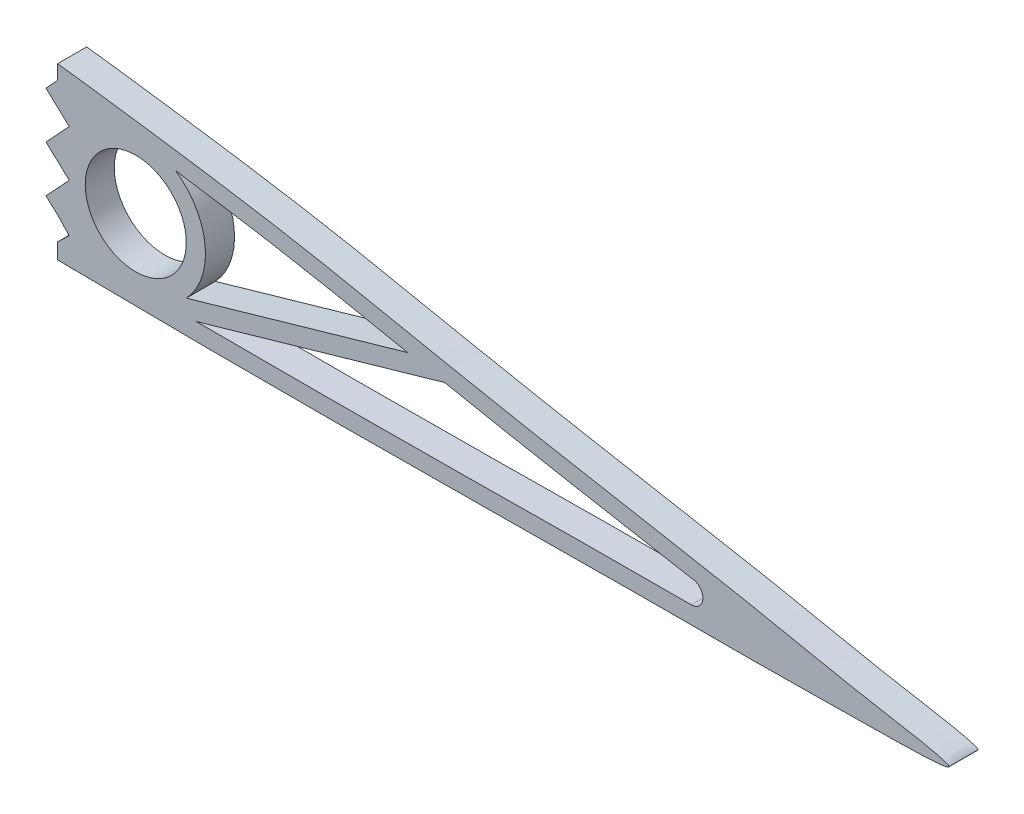
ISO-10303-21;
HEADER;
FILE_DESCRIPTION(('STEP AP214'),'2;1');
FILE_NAME('part.step','',(''),(''),'','','');
FILE_SCHEMA(('AUTOMOTIVE_DESIGN { 1 0 10303 214 1 1 1 1 }'));
ENDSEC;
DATA;
#1=APPLICATION_CONTEXT('core data for automotive mechanical design processes');
#2=APPLICATION_PROTOCOL_DEFINITION('international standard','automotive_design',2000,#1);
#3=PRODUCT_CONTEXT('',#1,'mechanical');
#4=PRODUCT('Part','Part','',(#3));
#5=PRODUCT_RELATED_PRODUCT_CATEGORY('part','',(#4));
#6=PRODUCT_DEFINITION_FORMATION('','',#4);
#7=PRODUCT_DEFINITION_CONTEXT('part definition',#1,'design');
#8=PRODUCT_DEFINITION('design','',#6,#7);
#9=PRODUCT_DEFINITION_SHAPE('','',#8);
#10=(LENGTH_UNIT() NAMED_UNIT(*) SI_UNIT(.MILLI.,.METRE.));
#11=(NAMED_UNIT(*) PLANE_ANGLE_UNIT() SI_UNIT($,.RADIAN.));
#12=(NAMED_UNIT(*) SI_UNIT($,.STERADIAN.) SOLID_ANGLE_UNIT());
#13=UNCERTAINTY_MEASURE_WITH_UNIT(LENGTH_MEASURE(1.E-05),#10,'distance_accuracy_value','');
#14=(GEOMETRIC_REPRESENTATION_CONTEXT(3) GLOBAL_UNCERTAINTY_ASSIGNED_CONTEXT((#13)) GLOBAL_UNIT_ASSIGNED_CONTEXT((#10,
#11,#12)) REPRESENTATION_CONTEXT('',''));
#15=CARTESIAN_POINT('',(0.,0.,0.));
#16=DIRECTION('',(0.,0.,1.));
#17=DIRECTION('',(1.,0.,0.));
#18=AXIS2_PLACEMENT_3D('',#15,#16,#17);
#19=CARTESIAN_POINT('',(160.714304874947,1.94266784174451,-0.0126133328246878));
#20=DIRECTION('',(-1.,0.,0.));
#21=DIRECTION('',(0.,0.,1.));
#22=AXIS2_PLACEMENT_3D('',#19,#20,#21);
#23=PLANE('',#22);
#24=DIRECTION('',(0.,0.,-1.));
#25=VECTOR('',#24,1.);
#26=CARTESIAN_POINT('',(160.714304874947,-1.48396448078185,-40.7418292483838));
#27=LINE('',#26,#25);
#28=CARTESIAN_POINT('',(160.714304874947,-1.48396448078185,6.35000000000003));
#29=VERTEX_POINT('',#28);
#30=CARTESIAN_POINT('',(160.714304874947,-1.48396448078185,0.));
#31=VERTEX_POINT('',#30);
#32=EDGE_CURVE('E352',#29,#31,#27,.T.);
#33=ORIENTED_EDGE('',*,*,#32,.F.);
#34=DIRECTION('',(0.,1.,0.));
#35=VECTOR('',#34,1.);
#36=CARTESIAN_POINT('',(160.714304874947,6.31608258581797,6.35));
#37=LINE('',#36,#35);
#38=CARTESIAN_POINT('',(160.714304874947,1.94266784174451,6.35));
#39=VERTEX_POINT('',#38);
#40=EDGE_CURVE('E292',#29,#39,#37,.T.);
#41=ORIENTED_EDGE('',*,*,#40,.T.);
#42=DIRECTION('',(0.,0.,1.));
#43=VECTOR('',#42,1.);
#44=CARTESIAN_POINT('',(160.714304874947,1.94266784174451,-0.0126133328246878));
#45=LINE('',#44,#43);
#46=CARTESIAN_POINT('',(160.714304874947,1.94266784174451,0.));
#47=VERTEX_POINT('',#46);
#48=EDGE_CURVE('E11',#47,#39,#45,.T.);
#49=ORIENTED_EDGE('',*,*,#48,.F.);
#50=DIRECTION('',(0.,1.,0.));
#51=VECTOR('',#50,1.);
#52=CARTESIAN_POINT('',(160.714304874947,6.31608258581797,0.));
#53=LINE('',#52,#51);
#54=EDGE_CURVE('E349',#31,#47,#53,.T.);
#55=ORIENTED_EDGE('',*,*,#54,.F.);
#56=EDGE_LOOP('',(#33,#41,#49,#55));
#57=FACE_BOUND('',#56,.T.);
#58=ADVANCED_FACE('F33',(#57),#23,.T.);
#59=CARTESIAN_POINT('',(163.254304874947,4.38005033954691,-0.0126133328246878));
#60=DIRECTION('',(-0.692381397123979,0.721531704720345,0.));
#61=DIRECTION('',(-0.721531704720345,-0.692381397123979,0.));
#62=AXIS2_PLACEMENT_3D('',#59,#60,#61);
#63=PLANE('',#62);
#64=ORIENTED_EDGE('',*,*,#48,.T.);
#65=DIRECTION('',(0.721531704720345,0.692381397123979,0.));
#66=VECTOR('',#65,1.);
#67=CARTESIAN_POINT('',(80.268140822794,-75.2534236055233,6.35));
#68=LINE('',#67,#66);
#69=CARTESIAN_POINT('',(163.254304874947,4.38005033954687,6.35));
#70=VERTEX_POINT('',#69);
#71=EDGE_CURVE('E295',#39,#70,#68,.T.);
#72=ORIENTED_EDGE('',*,*,#71,.T.);
#73=DIRECTION('',(0.,0.,1.));
#74=VECTOR('',#73,1.);
#75=CARTESIAN_POINT('',(163.254304874947,4.38005033954691,-0.0126133328246878));
#76=LINE('',#75,#74);
#77=CARTESIAN_POINT('',(163.254304874947,4.38005033954687,0.));
#78=VERTEX_POINT('',#77);
#79=EDGE_CURVE('E45',#78,#70,#76,.T.);
#80=ORIENTED_EDGE('',*,*,#79,.F.);
#81=DIRECTION('',(0.721531704720345,0.692381397123979,0.));
#82=VECTOR('',#81,1.);
#83=CARTESIAN_POINT('',(80.268140822794,-75.2534236055233,0.));
#84=LINE('',#83,#82);
#85=EDGE_CURVE('E346',#47,#78,#84,.T.);
#86=ORIENTED_EDGE('',*,*,#85,.F.);
#87=EDGE_LOOP('',(#64,#72,#80,#86));
#88=FACE_BOUND('',#87,.T.);
#89=ADVANCED_FACE('F390',(#88),#63,.T.);
#90=CARTESIAN_POINT('',(160.714304874947,7.02698819432221,-0.0126133328246878));
#91=DIRECTION('',(-0.721531704720345,-0.692381397123979,0.));
#92=DIRECTION('',(0.692381397123979,-0.721531704720345,0.));
#93=AXIS2_PLACEMENT_3D('',#90,#91,#92);
#94=PLANE('',#93);
#95=ORIENTED_EDGE('',*,*,#79,.T.);
#96=DIRECTION('',(-0.692381397123979,0.721531704720345,0.));
#97=VECTOR('',#96,1.);
#98=CARTESIAN_POINT('',(84.9802549752778,85.9495565308882,6.35));
#99=LINE('',#98,#97);
#100=CARTESIAN_POINT('',(160.714304874947,7.02698819432221,6.35));
#101=VERTEX_POINT('',#100);
#102=EDGE_CURVE('E298',#70,#101,#99,.T.);
#103=ORIENTED_EDGE('',*,*,#102,.T.);
#104=DIRECTION('',(0.,0.,1.));
#105=VECTOR('',#104,1.);
#106=CARTESIAN_POINT('',(160.714304874947,7.02698819432221,-0.0126133328246878));
#107=LINE('',#106,#105);
#108=CARTESIAN_POINT('',(160.714304874947,7.02698819432221,0.));
#109=VERTEX_POINT('',#108);
#110=EDGE_CURVE('E372',#109,#101,#107,.T.);
#111=ORIENTED_EDGE('',*,*,#110,.F.);
#112=DIRECTION('',(-0.692381397123979,0.721531704720345,0.));
#113=VECTOR('',#112,1.);
#114=CARTESIAN_POINT('',(84.9802549752778,85.9495565308882,0.));
#115=LINE('',#114,#113);
#116=EDGE_CURVE('E343',#78,#109,#115,.T.);
#117=ORIENTED_EDGE('',*,*,#116,.F.);
#118=EDGE_LOOP('',(#95,#103,#111,#117));
#119=FACE_BOUND('',#118,.T.);
#120=ADVANCED_FACE('F379',(#119),#94,.T.);
#121=CARTESIAN_POINT('',(158.174304874947,9.38977889197246,-0.0126133328246878));
#122=DIRECTION('',(-0.681103942473555,-0.732186738166556,0.));
#123=DIRECTION('',(0.732186738166556,-0.681103942473555,0.));
#124=AXIS2_PLACEMENT_3D('',#121,#122,#123);
#125=PLANE('',#124);
#126=ORIENTED_EDGE('',*,*,#110,.T.);
#127=DIRECTION('',(-0.732186738166556,0.681103942473555,0.));
#128=VECTOR('',#127,1.);
#129=CARTESIAN_POINT('',(75.9793330126459,85.8502178328666,6.35));
#130=LINE('',#129,#128);
#131=CARTESIAN_POINT('',(158.174304874947,9.38977889197247,6.35));
#132=VERTEX_POINT('',#131);
#133=EDGE_CURVE('E301',#101,#132,#130,.T.);
#134=ORIENTED_EDGE('',*,*,#133,.T.);
#135=DIRECTION('',(0.,0.,1.));
#136=VECTOR('',#135,1.);
#137=CARTESIAN_POINT('',(158.174304874947,9.38977889197246,-0.0126133328246878));
#138=LINE('',#137,#136);
#139=CARTESIAN_POINT('',(158.174304874947,9.38977889197247,0.));
#140=VERTEX_POINT('',#139);
#141=EDGE_CURVE('E369',#140,#132,#138,.T.);
#142=ORIENTED_EDGE('',*,*,#141,.F.);
#143=DIRECTION('',(-0.732186738166556,0.681103942473555,0.));
#144=VECTOR('',#143,1.);
#145=CARTESIAN_POINT('',(75.9793330126459,85.8502178328666,0.));
#146=LINE('',#145,#144);
#147=EDGE_CURVE('E340',#109,#140,#146,.T.);
#148=ORIENTED_EDGE('',*,*,#147,.F.);
#149=EDGE_LOOP('',(#126,#134,#142,#148));
#150=FACE_BOUND('',#149,.T.);
#151=ADVANCED_FACE('F399',(#150),#125,.T.);
#152=CARTESIAN_POINT('',(160.714304874947,12.1202788920004,-0.0126133328246878));
#153=DIRECTION('',(-0.732186738166556,0.681103942473555,0.));
#154=DIRECTION('',(-0.681103942473555,-0.732186738166556,0.));
#155=AXIS2_PLACEMENT_3D('',#152,#153,#154);
#156=PLANE('',#155);
#157=ORIENTED_EDGE('',*,*,#141,.T.);
#158=DIRECTION('',(0.681103942473555,0.732186738166556,0.));
#159=VECTOR('',#158,1.);
#160=CARTESIAN_POINT('',(84.1890627854258,-70.1443563550762,6.35));
#161=LINE('',#160,#159);
#162=CARTESIAN_POINT('',(163.254304874947,14.8507788920283,6.35));
#163=VERTEX_POINT('',#162);
#164=EDGE_CURVE('E304',#132,#163,#161,.T.);
#165=ORIENTED_EDGE('',*,*,#164,.T.);
#166=DIRECTION('',(0.,0.,1.));
#167=VECTOR('',#166,1.);
#168=CARTESIAN_POINT('',(163.254304874947,14.8507788920283,-0.0126133328246878));
#169=LINE('',#168,#167);
#170=CARTESIAN_POINT('',(163.254304874947,14.8507788920283,0.));
#171=VERTEX_POINT('',#170);
#172=EDGE_CURVE('E366',#171,#163,#169,.T.);
#173=ORIENTED_EDGE('',*,*,#172,.F.);
#174=DIRECTION('',(0.681103942473555,0.732186738166556,0.));
#175=VECTOR('',#174,1.);
#176=CARTESIAN_POINT('',(84.1890627854258,-70.1443563550762,0.));
#177=LINE('',#176,#175);
#178=EDGE_CURVE('E337',#140,#171,#177,.T.);
#179=ORIENTED_EDGE('',*,*,#178,.F.);
#180=EDGE_LOOP('',(#157,#165,#173,#179));
#181=FACE_BOUND('',#180,.T.);
#182=ADVANCED_FACE('F477',(#181),#156,.T.);
#183=CARTESIAN_POINT('',(160.714304874947,17.2135695896785,-0.0126133328246878));
#184=DIRECTION('',(-0.681103942473556,-0.732186738166555,0.));
#185=DIRECTION('',(0.732186738166555,-0.681103942473556,0.));
#186=AXIS2_PLACEMENT_3D('',#183,#184,#185);
#187=PLANE('',#186);
#188=ORIENTED_EDGE('',*,*,#172,.T.);
#189=DIRECTION('',(-0.732186738166555,0.681103942473556,0.));
#190=VECTOR('',#189,1.);
#191=CARTESIAN_POINT('',(81.0593330126461,91.3112178329224,6.35));
#192=LINE('',#191,#190);
#193=CARTESIAN_POINT('',(158.174304874947,19.5763602873288,6.35));
#194=VERTEX_POINT('',#193);
#195=EDGE_CURVE('E307',#163,#194,#192,.T.);
#196=ORIENTED_EDGE('',*,*,#195,.T.);
#197=DIRECTION('',(0.,0.,1.));
#198=VECTOR('',#197,1.);
#199=CARTESIAN_POINT('',(158.174304874947,19.5763602873287,-0.0126133328246878));
#200=LINE('',#199,#198);
#201=CARTESIAN_POINT('',(158.174304874947,19.5763602873288,0.));
#202=VERTEX_POINT('',#201);
#203=EDGE_CURVE('E363',#202,#194,#200,.T.);
#204=ORIENTED_EDGE('',*,*,#203,.F.);
#205=DIRECTION('',(-0.732186738166555,0.681103942473556,0.));
#206=VECTOR('',#205,1.);
#207=CARTESIAN_POINT('',(81.0593330126461,91.3112178329224,0.));
#208=LINE('',#207,#206);
#209=EDGE_CURVE('E334',#171,#202,#208,.T.);
#210=ORIENTED_EDGE('',*,*,#209,.F.);
#211=EDGE_LOOP('',(#188,#196,#204,#210));
#212=FACE_BOUND('',#211,.T.);
#213=ADVANCED_FACE('F473',(#212),#187,.T.);
#214=CARTESIAN_POINT('',(160.714304874947,22.3068602873566,-0.0126133328246878));
#215=DIRECTION('',(-0.732186738166556,0.681103942473555,0.));
#216=DIRECTION('',(-0.681103942473555,-0.732186738166556,0.));
#217=AXIS2_PLACEMENT_3D('',#214,#215,#216);
#218=PLANE('',#217);
#219=ORIENTED_EDGE('',*,*,#203,.T.);
#220=DIRECTION('',(0.681103942473555,0.732186738166556,0.));
#221=VECTOR('',#220,1.);
#222=CARTESIAN_POINT('',(79.1090627854259,-65.4187749597757,6.35));
#223=LINE('',#222,#221);
#224=CARTESIAN_POINT('',(163.254304874947,25.0373602873845,6.35));
#225=VERTEX_POINT('',#224);
#226=EDGE_CURVE('E310',#194,#225,#223,.T.);
#227=ORIENTED_EDGE('',*,*,#226,.T.);
#228=DIRECTION('',(0.,0.,1.));
#229=VECTOR('',#228,1.);
#230=CARTESIAN_POINT('',(163.254304874947,25.0373602873845,-0.0126133328246878));
#231=LINE('',#230,#229);
#232=CARTESIAN_POINT('',(163.254304874947,25.0373602873845,0.));
#233=VERTEX_POINT('',#232);
#234=EDGE_CURVE('E360',#233,#225,#231,.T.);
#235=ORIENTED_EDGE('',*,*,#234,.F.);
#236=DIRECTION('',(0.681103942473555,0.732186738166556,0.));
#237=VECTOR('',#236,1.);
#238=CARTESIAN_POINT('',(79.1090627854259,-65.4187749597757,0.));
#239=LINE('',#238,#237);
#240=EDGE_CURVE('E331',#202,#233,#239,.T.);
#241=ORIENTED_EDGE('',*,*,#240,.F.);
#242=EDGE_LOOP('',(#219,#227,#235,#241));
#243=FACE_BOUND('',#242,.T.);
#244=ADVANCED_FACE('F469',(#243),#218,.T.);
#245=CARTESIAN_POINT('',(160.714304874947,27.4001509850348,-0.0126133328246878));
#246=DIRECTION('',(-0.681103942473555,-0.732186738166556,0.));
#247=DIRECTION('',(0.732186738166556,-0.681103942473555,0.));
#248=AXIS2_PLACEMENT_3D('',#245,#246,#247);
#249=PLANE('',#248);
#250=ORIENTED_EDGE('',*,*,#234,.T.);
#251=DIRECTION('',(-0.732186738166556,0.681103942473555,0.));
#252=VECTOR('',#251,1.);
#253=CARTESIAN_POINT('',(86.1393330126459,96.7722178329782,6.35));
#254=LINE('',#253,#252);
#255=CARTESIAN_POINT('',(158.174304874947,29.7629416826851,6.35));
#256=VERTEX_POINT('',#255);
#257=EDGE_CURVE('E313',#225,#256,#254,.T.);
#258=ORIENTED_EDGE('',*,*,#257,.T.);
#259=DIRECTION('',(0.,0.,1.));
#260=VECTOR('',#259,1.);
#261=CARTESIAN_POINT('',(158.174304874947,29.762941682685,-0.0126133328246878));
#262=LINE('',#261,#260);
#263=CARTESIAN_POINT('',(158.174304874947,29.7629416826851,0.));
#264=VERTEX_POINT('',#263);
#265=EDGE_CURVE('E357',#264,#256,#262,.T.);
#266=ORIENTED_EDGE('',*,*,#265,.F.);
#267=DIRECTION('',(-0.732186738166556,0.681103942473555,0.));
#268=VECTOR('',#267,1.);
#269=CARTESIAN_POINT('',(86.1393330126459,96.7722178329782,0.));
#270=LINE('',#269,#268);
#271=EDGE_CURVE('E328',#233,#264,#270,.T.);
#272=ORIENTED_EDGE('',*,*,#271,.F.);
#273=EDGE_LOOP('',(#250,#258,#266,#272));
#274=FACE_BOUND('',#273,.T.);
#275=ADVANCED_FACE('F475',(#274),#249,.T.);
#276=CARTESIAN_POINT('',(160.714304874947,32.4934416827129,-0.0126133328246878));
#277=DIRECTION('',(-1.,0.,0.));
#278=DIRECTION('',(0.,0.,1.));
#279=AXIS2_PLACEMENT_3D('',#276,#277,#278);
#280=PLANE('',#279);
#281=DIRECTION('',(0.,0.,1.));
#282=VECTOR('',#281,1.);
#283=CARTESIAN_POINT('',(160.714304874947,32.4934416827129,-0.0126133328246878));
#284=LINE('',#283,#282);
#285=CARTESIAN_POINT('',(160.714304874947,32.4934416827129,0.));
#286=VERTEX_POINT('',#285);
#287=CARTESIAN_POINT('',(160.714304874947,32.4934416827129,6.35));
#288=VERTEX_POINT('',#287);
#289=EDGE_CURVE('E157',#286,#288,#284,.T.);
#290=ORIENTED_EDGE('',*,*,#289,.T.);
#291=DIRECTION('',(0.,1.,0.));
#292=VECTOR('',#291,1.);
#293=CARTESIAN_POINT('',(160.714304874947,6.31608258581797,6.35));
#294=LINE('',#293,#292);
#295=CARTESIAN_POINT('',(160.714304874947,35.6684416827129,6.35));
#296=VERTEX_POINT('',#295);
#297=EDGE_CURVE('E319',#288,#296,#294,.T.);
#298=ORIENTED_EDGE('',*,*,#297,.T.);
#299=DIRECTION('',(0.,0.,-1.));
#300=VECTOR('',#299,1.);
#301=CARTESIAN_POINT('',(160.714304874947,35.6684416827129,6.35));
#302=LINE('',#301,#300);
#303=CARTESIAN_POINT('',(160.714304874947,35.6684416827129,0.));
#304=VERTEX_POINT('',#303);
#305=EDGE_CURVE('E286',#296,#304,#302,.T.);
#306=ORIENTED_EDGE('',*,*,#305,.T.);
#307=DIRECTION('',(0.,1.,0.));
#308=VECTOR('',#307,1.);
#309=CARTESIAN_POINT('',(160.714304874947,6.31608258581797,0.));
#310=LINE('',#309,#308);
#311=EDGE_CURVE('E322',#286,#304,#310,.T.);
#312=ORIENTED_EDGE('',*,*,#311,.F.);
#313=EDGE_LOOP('',(#290,#298,#306,#312));
#314=FACE_BOUND('',#313,.T.);
#315=ADVANCED_FACE('F178',(#314),#280,.T.);
#316=CARTESIAN_POINT('',(158.174304874947,29.762941682685,-0.0126133328246878));
#317=DIRECTION('',(-0.732186738166556,0.681103942473555,0.));
#318=DIRECTION('',(-0.681103942473555,-0.732186738166556,0.));
#319=AXIS2_PLACEMENT_3D('',#316,#317,#318);
#320=PLANE('',#319);
#321=ORIENTED_EDGE('',*,*,#265,.T.);
#322=DIRECTION('',(0.681103942473555,0.732186738166556,0.));
#323=VECTOR('',#322,1.);
#324=CARTESIAN_POINT('',(74.0290627854258,-60.6931935644752,6.35));
#325=LINE('',#324,#323);
#326=EDGE_CURVE('E316',#256,#288,#325,.T.);
#327=ORIENTED_EDGE('',*,*,#326,.T.);
#328=ORIENTED_EDGE('',*,*,#289,.F.);
#329=DIRECTION('',(0.681103942473555,0.732186738166556,0.));
#330=VECTOR('',#329,1.);
#331=CARTESIAN_POINT('',(74.0290627854258,-60.6931935644752,0.));
#332=LINE('',#331,#330);
#333=EDGE_CURVE('E325',#264,#286,#332,.T.);
#334=ORIENTED_EDGE('',*,*,#333,.F.);
#335=EDGE_LOOP('',(#321,#327,#328,#334));
#336=FACE_BOUND('',#335,.T.);
#337=ADVANCED_FACE('F489',(#336),#320,.T.);
#338=CARTESIAN_POINT('',(177.8,15.8385784888495,49.4552293811319));
#339=DIRECTION('',(0.,0.,-1.));
#340=DIRECTION('',(-1.,0.,0.));
#341=AXIS2_PLACEMENT_3D('',#338,#339,#340);
#342=CYLINDRICAL_SURFACE('',#341,11.049);
#343=CARTESIAN_POINT('',(177.8,15.8385784888495,6.35));
#344=DIRECTION('',(0.,0.,-1.));
#345=DIRECTION('',(-1.,0.,0.));
#346=AXIS2_PLACEMENT_3D('',#343,#344,#345);
#347=CIRCLE('',#346,11.049);
#348=CARTESIAN_POINT('',(166.751,15.8385784888495,6.35));
#349=VERTEX_POINT('',#348);
#350=EDGE_CURVE('E129',#349,#349,#347,.F.);
#351=ORIENTED_EDGE('',*,*,#350,.T.);
#352=EDGE_LOOP('',(#351));
#353=FACE_BOUND('',#352,.T.);
#354=CARTESIAN_POINT('',(177.8,15.8385784888495,0.));
#355=DIRECTION('',(0.,0.,-1.));
#356=DIRECTION('',(-1.,0.,0.));
#357=AXIS2_PLACEMENT_3D('',#354,#355,#356);
#358=CIRCLE('',#357,11.049);
#359=CARTESIAN_POINT('',(166.751,15.8385784888495,0.));
#360=VERTEX_POINT('',#359);
#361=EDGE_CURVE('E262',#360,#360,#358,.T.);
#362=ORIENTED_EDGE('',*,*,#361,.T.);
#363=EDGE_LOOP('',(#362));
#364=FACE_BOUND('',#363,.T.);
#365=ADVANCED_FACE('F486',(#353,#364),#342,.F.);
#366=CARTESIAN_POINT('',(298.585401197704,7.67396492833068,6.35));
#367=DIRECTION('',(-0.18053615701338,-0.983568348418574,0.));
#368=DIRECTION('',(0.983568348418574,-0.18053615701338,0.));
#369=AXIS2_PLACEMENT_3D('',#366,#367,#368);
#370=PLANE('',#369);
#371=DIRECTION('',(-0.983568348418574,0.18053615701338,0.));
#372=VECTOR('',#371,1.);
#373=CARTESIAN_POINT('',(298.585401197704,7.67396492833068,0.));
#374=LINE('',#373,#372);
#375=CARTESIAN_POINT('',(299.270885690448,7.5481427257241,0.));
#376=VERTEX_POINT('',#375);
#377=CARTESIAN_POINT('',(298.585401197704,7.67396492833066,0.));
#378=VERTEX_POINT('',#377);
#379=EDGE_CURVE('E246',#376,#378,#374,.T.);
#380=ORIENTED_EDGE('',*,*,#379,.F.);
#381=DIRECTION('',(0.,0.,-1.));
#382=VECTOR('',#381,1.);
#383=CARTESIAN_POINT('',(299.270885690448,7.5481427257241,6.35));
#384=LINE('',#383,#382);
#385=CARTESIAN_POINT('',(299.270885690448,7.54814272572409,6.35));
#386=VERTEX_POINT('',#385);
#387=EDGE_CURVE('E240',#386,#376,#384,.T.);
#388=ORIENTED_EDGE('',*,*,#387,.F.);
#389=DIRECTION('',(-0.983568348418574,0.18053615701338,0.));
#390=VECTOR('',#389,1.);
#391=CARTESIAN_POINT('',(298.585401197704,7.67396492833068,6.35));
#392=LINE('',#391,#390);
#393=CARTESIAN_POINT('',(298.585401197704,7.67396492833068,6.35));
#394=VERTEX_POINT('',#393);
#395=EDGE_CURVE('E245',#386,#394,#392,.T.);
#396=ORIENTED_EDGE('',*,*,#395,.T.);
#397=DIRECTION('',(0.,0.,-1.));
#398=VECTOR('',#397,1.);
#399=CARTESIAN_POINT('',(298.585401197704,7.67396492833068,6.35));
#400=LINE('',#399,#398);
#401=EDGE_CURVE('E242',#394,#378,#400,.T.);
#402=ORIENTED_EDGE('',*,*,#401,.T.);
#403=EDGE_LOOP('',(#380,#388,#396,#402));
#404=FACE_BOUND('',#403,.T.);
#405=ADVANCED_FACE('F488',(#404),#370,.T.);
#406=CARTESIAN_POINT('',(299.270885690451,5.0124239966776,6.35));
#407=DIRECTION('',(0.,0.,-1.));
#408=DIRECTION('',(-1.,0.,0.));
#409=AXIS2_PLACEMENT_3D('',#406,#407,#408);
#410=CYLINDRICAL_SURFACE('',#409,2.53571872904618);
#411=CARTESIAN_POINT('',(299.270885690451,5.0124239966776,0.));
#412=DIRECTION('',(0.,0.,1.));
#413=DIRECTION('',(-1.,0.,0.));
#414=AXIS2_PLACEMENT_3D('',#411,#412,#413);
#415=CIRCLE('',#414,2.53571872904618);
#416=CARTESIAN_POINT('',(299.270885690451,2.47670526763142,0.));
#417=VERTEX_POINT('',#416);
#418=EDGE_CURVE('E249',#417,#376,#415,.T.);
#419=ORIENTED_EDGE('',*,*,#418,.F.);
#420=DIRECTION('',(0.,0.,-1.));
#421=VECTOR('',#420,1.);
#422=CARTESIAN_POINT('',(299.270885690451,2.47670526763142,6.35));
#423=LINE('',#422,#421);
#424=CARTESIAN_POINT('',(299.270885690451,2.47670526763142,6.35));
#425=VERTEX_POINT('',#424);
#426=EDGE_CURVE('E237',#425,#417,#423,.T.);
#427=ORIENTED_EDGE('',*,*,#426,.F.);
#428=CARTESIAN_POINT('',(299.270885690451,5.0124239966776,6.35));
#429=DIRECTION('',(0.,0.,1.));
#430=DIRECTION('',(-1.,0.,0.));
#431=AXIS2_PLACEMENT_3D('',#428,#429,#430);
#432=CIRCLE('',#431,2.53571872904618);
#433=EDGE_CURVE('E162',#425,#386,#432,.T.);
#434=ORIENTED_EDGE('',*,*,#433,.T.);
#435=ORIENTED_EDGE('',*,*,#387,.T.);
#436=EDGE_LOOP('',(#419,#427,#434,#435));
#437=FACE_BOUND('',#436,.T.);
#438=ADVANCED_FACE('F174',(#437),#410,.F.);
#439=CARTESIAN_POINT('',(298.585401197704,7.67396492833068,6.35));
#440=CARTESIAN_POINT('',(292.106452898494,8.86319029259587,6.35));
#441=CARTESIAN_POINT('',(278.998722850691,11.2160768217091,6.35));
#442=CARTESIAN_POINT('',(260.19281594541,14.6614639423051,6.35));
#443=CARTESIAN_POINT('',(241.464676652205,18.3546402802779,6.35));
#444=CARTESIAN_POINT('',(222.627905102774,22.2809005256109,6.35));
#445=CARTESIAN_POINT('',(203.840407925316,25.7328156234177,6.35));
#446=CARTESIAN_POINT('',(184.940591078368,28.567271431143,6.35));
#447=CARTESIAN_POINT('',(165.928243186971,31.2418483670052,6.35));
#448=CARTESIAN_POINT('',(147.007574717095,33.486695381412,6.35));
#449=CARTESIAN_POINT('',(128.106318529901,34.52483508266,6.35));
#450=CARTESIAN_POINT('',(109.031352068831,34.4819079791814,6.35));
#451=CARTESIAN_POINT('',(93.1136836747986,33.9410772373976,6.35));
#452=CARTESIAN_POINT('',(80.4929697852541,33.0121230489318,6.35));
#453=CARTESIAN_POINT('',(71.0914879230405,32.0025071410935,6.35));
#454=CARTESIAN_POINT('',(61.7494496654783,30.6167962665281,6.35));
#455=CARTESIAN_POINT('',(52.3384986575689,28.94143121451,6.35));
#456=CARTESIAN_POINT('',(44.6487868989379,27.358833750053,6.35));
#457=CARTESIAN_POINT('',(38.7509214246881,25.7058615915016,6.35));
#458=CARTESIAN_POINT('',(34.4843785915619,24.2081487117199,6.35));
#459=CARTESIAN_POINT('',(30.2559035386202,22.3994268830115,6.35));
#460=CARTESIAN_POINT('',(26.058813235538,20.3756210831138,6.35));
#461=CARTESIAN_POINT('',(22.0036472546043,18.204573648005,6.35));
#462=CARTESIAN_POINT('',(18.073379413511,15.8100788757996,6.35));
#463=CARTESIAN_POINT('',(14.3004980889778,13.1675355441417,6.35));
#464=CARTESIAN_POINT('',(10.8425883842659,10.346717823075,6.35));
#465=CARTESIAN_POINT('',(8.31614913329825,7.87852322387046,6.35));
#466=CARTESIAN_POINT('',(6.118421422811,5.45033050153012,6.35));
#467=CARTESIAN_POINT('',(4.71156691550159,3.64485128212432,6.35));
#468=CARTESIAN_POINT('',(3.82819229019897,2.03538026917779,6.35));
#469=CARTESIAN_POINT('',(3.66927370619398,1.18803917889276,6.35));
#470=CARTESIAN_POINT('',(3.69580851299745,0.901780341293524,6.35));
#471=CARTESIAN_POINT('',(3.76392337213765,0.659356905366162,6.35));
#472=CARTESIAN_POINT('',(4.01177210703508,0.200466571261727,6.35));
#473=CARTESIAN_POINT('',(4.55993640760143,-0.477894272217678,6.35));
#474=CARTESIAN_POINT('',(5.58769107350569,-1.25384310119448,6.35));
#475=CARTESIAN_POINT('',(6.62194987018579,-1.61326662725895,6.35));
#476=CARTESIAN_POINT('',(8.11112957209022,-1.74667270997234,6.35));
#477=CARTESIAN_POINT('',(9.64455130381317,-1.76556269330385,6.35));
#478=CARTESIAN_POINT('',(11.1612970101568,-1.76533947622617,6.35));
#479=CARTESIAN_POINT('',(13.0773460430556,-1.718276546918,6.35));
#480=CARTESIAN_POINT('',(16.1685738115504,-1.56923775175577,6.35));
#481=CARTESIAN_POINT('',(20.1027383710285,-1.28712846690174,6.35));
#482=CARTESIAN_POINT('',(24.8762276638194,-0.894572912775383,6.35));
#483=CARTESIAN_POINT('',(31.3140837481257,-0.396407216855068,6.35));
#484=CARTESIAN_POINT('',(39.354416994416,0.108840440369224,6.35));
#485=CARTESIAN_POINT('',(48.9910848157053,0.569369556329718,6.35));
#486=CARTESIAN_POINT('',(58.598869096045,0.966979136812708,6.35));
#487=CARTESIAN_POINT('',(71.4213055915985,1.44892697557836,6.35));
#488=CARTESIAN_POINT('',(87.4568745426644,1.9149141245086,6.35));
#489=CARTESIAN_POINT('',(106.691498300875,2.29027741828574,6.35));
#490=CARTESIAN_POINT('',(125.928970904147,2.52614101951955,6.35));
#491=CARTESIAN_POINT('',(145.197337534287,2.53687351302167,6.35));
#492=CARTESIAN_POINT('',(164.439341866281,2.27879585122089,6.35));
#493=CARTESIAN_POINT('',(183.609554157809,2.03186753594113,6.35));
#494=CARTESIAN_POINT('',(202.774070292494,1.95232887759459,6.35));
#495=CARTESIAN_POINT('',(222.001567212871,1.96761079521121,6.35));
#496=CARTESIAN_POINT('',(241.25002264645,2.0596159486339,6.35));
#497=CARTESIAN_POINT('',(260.261405857977,2.24939844248829,6.35));
#498=CARTESIAN_POINT('',(279.347929279361,2.45582693918431,6.35));
#499=CARTESIAN_POINT('',(292.680570508139,2.47262607714709,6.35));
#500=CARTESIAN_POINT('',(299.270885690451,2.47670526763173,6.35));
#501=B_SPLINE_CURVE_WITH_KNOTS('',3,(#439,#440,#441,#442,#443,#444,#445,#446,#447,#448,#449,
#450,#451,#452,#453,#454,#455,#456,#457,#458,#459,#460,#461,#462,#463,#464,#465,#466,#467,#468,
#469,#470,#471,#472,#473,#474,#475,#476,#477,#478,#479,#480,#481,#482,#483,#484,#485,#486,#487,
#488,#489,#490,#491,#492,#493,#494,#495,#496,#497,#498,#499,#500),.UNSPECIFIED.,.F.,.F.,(4,1,1,
1,1,1,1,1,1,1,1,1,1,1,1,1,1,1,1,1,1,1,1,1,1,1,1,1,1,1,1,1,1,1,1,1,1,1,1,1,1,1,1,1,1,1,1,1,1,1,1,
1,1,1,1,1,1,1,1,4),(0.0794437571451954,0.10577744952596,0.132111141906725,0.158444834287489,
0.184778526668254,0.211112219049019,0.237445911429783,0.263779603810548,0.290113296191313,
0.316446988572078,0.342780680952842,0.369114373333607,0.382281219523989,0.395448065714372,
0.408614911904754,0.421781758095136,0.434948604285519,0.44153202738071,0.448115450475901,
0.454698873571092,0.461282296666283,0.467865719761474,0.474449142856666,0.481032565951857,
0.487615989047048,0.494199412142239,0.497491123689835,0.50078283523743,0.504074546785026,
0.507366258332622,0.509012114106419,0.510657969880217,0.512303825654015,0.513949681427813,
0.517241392975408,0.520533104523004,0.523824816070599,0.525470671844397,0.527116527618195,
0.530408239165791,0.533699950713386,0.540283373808577,0.546866796903769,0.55345021999896,
0.566617066189342,0.579783912379724,0.592950758570107,0.606117604760489,0.632451297141254,
0.658784989522018,0.685118681902783,0.711452374283548,0.737786066664312,0.764119759045077,
0.790453451425842,0.816787143806606,0.843120836187371,0.869454528568136,0.895788220948901,
0.922121913329665),.UNSPECIFIED.);
#502=DIRECTION('',(0.,0.,-1.));
#503=VECTOR('',#502,1.);
#504=SURFACE_OF_LINEAR_EXTRUSION('',#501,#503);
#505=DIRECTION('',(0.,0.,-1.));
#506=VECTOR('',#505,1.);
#507=CARTESIAN_POINT('',(191.042155799633,2.00834412743153,6.35));
#508=LINE('',#507,#506);
#509=CARTESIAN_POINT('',(191.042155799633,2.00834412743153,6.35));
#510=VERTEX_POINT('',#509);
#511=CARTESIAN_POINT('',(191.042155799633,2.00834412743153,0.));
#512=VERTEX_POINT('',#511);
#513=EDGE_CURVE('E140',#510,#512,#508,.T.);
#514=ORIENTED_EDGE('',*,*,#513,.F.);
#515=EDGE_CURVE('E163',#510,#425,#501,.T.);
#516=ORIENTED_EDGE('',*,*,#515,.T.);
#517=ORIENTED_EDGE('',*,*,#426,.T.);
#518=CARTESIAN_POINT('',(298.585401197704,7.67396492833068,0.));
#519=CARTESIAN_POINT('',(292.106452898494,8.86319029259587,0.));
#520=CARTESIAN_POINT('',(278.998722850691,11.2160768217091,0.));
#521=CARTESIAN_POINT('',(260.19281594541,14.6614639423051,0.));
#522=CARTESIAN_POINT('',(241.464676652205,18.3546402802779,0.));
#523=CARTESIAN_POINT('',(222.627905102774,22.2809005256109,0.));
#524=CARTESIAN_POINT('',(203.840407925316,25.7328156234177,0.));
#525=CARTESIAN_POINT('',(184.940591078368,28.567271431143,0.));
#526=CARTESIAN_POINT('',(165.928243186971,31.2418483670052,0.));
#527=CARTESIAN_POINT('',(147.007574717095,33.486695381412,0.));
#528=CARTESIAN_POINT('',(128.106318529901,34.52483508266,0.));
#529=CARTESIAN_POINT('',(109.031352068831,34.4819079791814,0.));
#530=CARTESIAN_POINT('',(93.1136836747986,33.9410772373976,0.));
#531=CARTESIAN_POINT('',(80.4929697852541,33.0121230489318,0.));
#532=CARTESIAN_POINT('',(71.0914879230405,32.0025071410935,0.));
#533=CARTESIAN_POINT('',(61.7494496654783,30.6167962665281,0.));
#534=CARTESIAN_POINT('',(52.3384986575689,28.94143121451,0.));
#535=CARTESIAN_POINT('',(44.6487868989379,27.358833750053,0.));
#536=CARTESIAN_POINT('',(38.7509214246881,25.7058615915016,0.));
#537=CARTESIAN_POINT('',(34.4843785915619,24.2081487117199,0.));
#538=CARTESIAN_POINT('',(30.2559035386202,22.3994268830115,0.));
#539=CARTESIAN_POINT('',(26.058813235538,20.3756210831138,0.));
#540=CARTESIAN_POINT('',(22.0036472546043,18.204573648005,0.));
#541=CARTESIAN_POINT('',(18.073379413511,15.8100788757996,0.));
#542=CARTESIAN_POINT('',(14.3004980889778,13.1675355441417,0.));
#543=CARTESIAN_POINT('',(10.8425883842659,10.346717823075,0.));
#544=CARTESIAN_POINT('',(8.31614913329825,7.87852322387046,0.));
#545=CARTESIAN_POINT('',(6.118421422811,5.45033050153012,0.));
#546=CARTESIAN_POINT('',(4.71156691550159,3.64485128212432,0.));
#547=CARTESIAN_POINT('',(3.82819229019897,2.03538026917779,0.));
#548=CARTESIAN_POINT('',(3.66927370619398,1.18803917889276,0.));
#549=CARTESIAN_POINT('',(3.69580851299745,0.901780341293524,0.));
#550=CARTESIAN_POINT('',(3.76392337213765,0.659356905366162,0.));
#551=CARTESIAN_POINT('',(4.01177210703508,0.200466571261727,0.));
#552=CARTESIAN_POINT('',(4.55993640760143,-0.477894272217678,0.));
#553=CARTESIAN_POINT('',(5.58769107350569,-1.25384310119448,0.));
#554=CARTESIAN_POINT('',(6.62194987018579,-1.61326662725895,0.));
#555=CARTESIAN_POINT('',(8.11112957209022,-1.74667270997234,0.));
#556=CARTESIAN_POINT('',(9.64455130381317,-1.76556269330385,0.));
#557=CARTESIAN_POINT('',(11.1612970101568,-1.76533947622617,0.));
#558=CARTESIAN_POINT('',(13.0773460430556,-1.718276546918,0.));
#559=CARTESIAN_POINT('',(16.1685738115504,-1.56923775175577,0.));
#560=CARTESIAN_POINT('',(20.1027383710285,-1.28712846690174,0.));
#561=CARTESIAN_POINT('',(24.8762276638194,-0.894572912775383,0.));
#562=CARTESIAN_POINT('',(31.3140837481257,-0.396407216855068,0.));
#563=CARTESIAN_POINT('',(39.354416994416,0.108840440369224,0.));
#564=CARTESIAN_POINT('',(48.9910848157053,0.569369556329718,0.));
#565=CARTESIAN_POINT('',(58.598869096045,0.966979136812708,0.));
#566=CARTESIAN_POINT('',(71.4213055915985,1.44892697557836,0.));
#567=CARTESIAN_POINT('',(87.4568745426644,1.9149141245086,0.));
#568=CARTESIAN_POINT('',(106.691498300875,2.29027741828574,0.));
#569=CARTESIAN_POINT('',(125.928970904147,2.52614101951955,0.));
#570=CARTESIAN_POINT('',(145.197337534287,2.53687351302167,0.));
#571=CARTESIAN_POINT('',(164.439341866281,2.27879585122089,0.));
#572=CARTESIAN_POINT('',(183.609554157809,2.03186753594113,0.));
#573=CARTESIAN_POINT('',(202.774070292494,1.95232887759459,0.));
#574=CARTESIAN_POINT('',(222.001567212871,1.96761079521121,0.));
#575=CARTESIAN_POINT('',(241.25002264645,2.0596159486339,0.));
#576=CARTESIAN_POINT('',(260.261405857977,2.24939844248829,0.));
#577=CARTESIAN_POINT('',(279.347929279361,2.45582693918431,0.));
#578=CARTESIAN_POINT('',(292.680570508139,2.47262607714709,0.));
#579=CARTESIAN_POINT('',(299.270885690451,2.47670526763173,0.));
#580=B_SPLINE_CURVE_WITH_KNOTS('',3,(#518,#519,#520,#521,#522,#523,#524,#525,#526,#527,#528,
#529,#530,#531,#532,#533,#534,#535,#536,#537,#538,#539,#540,#541,#542,#543,#544,#545,#546,#547,
#548,#549,#550,#551,#552,#553,#554,#555,#556,#557,#558,#559,#560,#561,#562,#563,#564,#565,#566,
#567,#568,#569,#570,#571,#572,#573,#574,#575,#576,#577,#578,#579),.UNSPECIFIED.,.F.,.F.,(4,1,1,
1,1,1,1,1,1,1,1,1,1,1,1,1,1,1,1,1,1,1,1,1,1,1,1,1,1,1,1,1,1,1,1,1,1,1,1,1,1,1,1,1,1,1,1,1,1,1,1,
1,1,1,1,1,1,1,1,4),(0.0794437571451954,0.10577744952596,0.132111141906725,0.158444834287489,
0.184778526668254,0.211112219049019,0.237445911429783,0.263779603810548,0.290113296191313,
0.316446988572078,0.342780680952842,0.369114373333607,0.382281219523989,0.395448065714372,
0.408614911904754,0.421781758095136,0.434948604285519,0.44153202738071,0.448115450475901,
0.454698873571092,0.461282296666283,0.467865719761474,0.474449142856666,0.481032565951857,
0.487615989047048,0.494199412142239,0.497491123689835,0.50078283523743,0.504074546785026,
0.507366258332622,0.509012114106419,0.510657969880217,0.512303825654015,0.513949681427813,
0.517241392975408,0.520533104523004,0.523824816070599,0.525470671844397,0.527116527618195,
0.530408239165791,0.533699950713386,0.540283373808577,0.546866796903769,0.55345021999896,
0.566617066189342,0.579783912379724,0.592950758570107,0.606117604760489,0.632451297141254,
0.658784989522018,0.685118681902783,0.711452374283548,0.737786066664312,0.764119759045077,
0.790453451425842,0.816787143806606,0.843120836187371,0.869454528568136,0.895788220948901,
0.922121913329665),.UNSPECIFIED.);
#581=EDGE_CURVE('E257',#512,#417,#580,.T.);
#582=ORIENTED_EDGE('',*,*,#581,.F.);
#583=EDGE_LOOP('',(#514,#516,#517,#582));
#584=FACE_BOUND('',#583,.T.);
#585=ADVANCED_FACE('F169',(#584),#504,.T.);
#586=CARTESIAN_POINT('',(241.82581887272,16.5922294585428,-123.523723940641));
#587=DIRECTION('',(0.276020405627321,-0.961151775567901,0.));
#588=DIRECTION('',(0.961151775567901,0.276020405627321,0.));
#589=AXIS2_PLACEMENT_3D('',#586,#587,#588);
#590=PLANE('',#589);
#591=DIRECTION('',(0.961151775567901,0.276020405627321,0.));
#592=VECTOR('',#591,1.);
#593=CARTESIAN_POINT('',(241.82581887272,16.5922294585428,6.35));
#594=LINE('',#593,#592);
#595=CARTESIAN_POINT('',(245.354284135663,17.6055225074413,6.35));
#596=VERTEX_POINT('',#595);
#597=EDGE_CURVE('E146',#510,#596,#594,.T.);
#598=ORIENTED_EDGE('',*,*,#597,.F.);
#599=ORIENTED_EDGE('',*,*,#513,.T.);
#600=DIRECTION('',(0.961151775567901,0.276020405627321,0.));
#601=VECTOR('',#600,1.);
#602=CARTESIAN_POINT('',(241.82581887272,16.5922294585428,0.));
#603=LINE('',#602,#601);
#604=CARTESIAN_POINT('',(245.354284164866,17.6055225015881,0.));
#605=VERTEX_POINT('',#604);
#606=EDGE_CURVE('E269',#512,#605,#603,.T.);
#607=ORIENTED_EDGE('',*,*,#606,.T.);
#608=DIRECTION('',(0.,0.,1.));
#609=VECTOR('',#608,1.);
#610=CARTESIAN_POINT('',(245.354284135663,17.6055225074413,-123.523723940641));
#611=LINE('',#610,#609);
#612=EDGE_CURVE('E267',#605,#596,#611,.T.);
#613=ORIENTED_EDGE('',*,*,#612,.T.);
#614=EDGE_LOOP('',(#598,#599,#607,#613));
#615=FACE_BOUND('',#614,.T.);
#616=ADVANCED_FACE('F173',(#615),#590,.T.);
#617=ORIENTED_EDGE('',*,*,#612,.F.);
#618=EDGE_CURVE('E252',#378,#605,#580,.T.);
#619=ORIENTED_EDGE('',*,*,#618,.F.);
#620=ORIENTED_EDGE('',*,*,#401,.F.);
#621=EDGE_CURVE('E158',#394,#596,#501,.T.);
#622=ORIENTED_EDGE('',*,*,#621,.T.);
#623=EDGE_LOOP('',(#617,#619,#620,#622));
#624=FACE_BOUND('',#623,.T.);
#625=ADVANCED_FACE('F176',(#624),#504,.T.);
#626=DIRECTION('',(0.,0.,-1.));
#627=VECTOR('',#626,1.);
#628=CARTESIAN_POINT('',(237.263319049405,19.245979899348,6.35));
#629=LINE('',#628,#627);
#630=CARTESIAN_POINT('',(237.263319049409,19.2459798993473,6.35));
#631=VERTEX_POINT('',#630);
#632=CARTESIAN_POINT('',(237.263319049409,19.2459798993473,0.));
#633=VERTEX_POINT('',#632);
#634=EDGE_CURVE('E264',#631,#633,#629,.T.);
#635=ORIENTED_EDGE('',*,*,#634,.F.);
#636=CARTESIAN_POINT('',(186.573409021337,28.2999144583322,6.35));
#637=VERTEX_POINT('',#636);
#638=EDGE_CURVE('E144',#631,#637,#501,.T.);
#639=ORIENTED_EDGE('',*,*,#638,.T.);
#640=DIRECTION('',(0.,0.,-1.));
#641=VECTOR('',#640,1.);
#642=CARTESIAN_POINT('',(186.573409021337,28.2999144583322,6.35));
#643=LINE('',#642,#641);
#644=CARTESIAN_POINT('',(186.573409021337,28.2999144583322,0.));
#645=VERTEX_POINT('',#644);
#646=EDGE_CURVE('E125',#645,#637,#643,.F.);
#647=ORIENTED_EDGE('',*,*,#646,.F.);
#648=EDGE_CURVE('E281',#633,#645,#580,.T.);
#649=ORIENTED_EDGE('',*,*,#648,.F.);
#650=EDGE_LOOP('',(#635,#639,#647,#649));
#651=FACE_BOUND('',#650,.T.);
#652=ADVANCED_FACE('F177',(#651),#504,.T.);
#653=CARTESIAN_POINT('',(240.77418112728,20.2542177234566,-123.523723940641));
#654=DIRECTION('',(-0.276020405627321,0.961151775567901,0.));
#655=DIRECTION('',(-0.961151775567901,-0.276020405627321,0.));
#656=AXIS2_PLACEMENT_3D('',#653,#654,#655);
#657=PLANE('',#656);
#658=DIRECTION('',(-0.961151775567901,-0.276020405627321,0.));
#659=VECTOR('',#658,1.);
#660=CARTESIAN_POINT('',(240.77418112728,20.2542177234566,6.35));
#661=LINE('',#660,#659);
#662=CARTESIAN_POINT('',(188.849612939668,5.34269101405633,6.35));
#663=VERTEX_POINT('',#662);
#664=EDGE_CURVE('E136',#631,#663,#661,.T.);
#665=ORIENTED_EDGE('',*,*,#664,.F.);
#666=ORIENTED_EDGE('',*,*,#634,.T.);
#667=DIRECTION('',(-0.961151775567901,-0.276020405627321,0.));
#668=VECTOR('',#667,1.);
#669=CARTESIAN_POINT('',(240.77418112728,20.2542177234566,0.));
#670=LINE('',#669,#668);
#671=CARTESIAN_POINT('',(188.849612939668,5.34269101405633,0.));
#672=VERTEX_POINT('',#671);
#673=EDGE_CURVE('E138',#633,#672,#670,.T.);
#674=ORIENTED_EDGE('',*,*,#673,.T.);
#675=DIRECTION('',(0.,0.,-1.));
#676=VECTOR('',#675,1.);
#677=CARTESIAN_POINT('',(188.849612939668,5.34269101405634,49.4552293811319));
#678=LINE('',#677,#676);
#679=EDGE_CURVE('E122',#672,#663,#678,.F.);
#680=ORIENTED_EDGE('',*,*,#679,.T.);
#681=EDGE_LOOP('',(#665,#666,#674,#680));
#682=FACE_BOUND('',#681,.T.);
#683=ADVANCED_FACE('F134',(#682),#657,.T.);
#684=CARTESIAN_POINT('',(177.8,15.8385784888495,49.4552293811319));
#685=DIRECTION('',(0.,0.,-1.));
#686=DIRECTION('',(-1.,0.,0.));
#687=AXIS2_PLACEMENT_3D('',#684,#685,#686);
#688=CYLINDRICAL_SURFACE('',#687,15.24);
#689=ORIENTED_EDGE('',*,*,#679,.F.);
#690=CARTESIAN_POINT('',(177.8,15.8385784888495,0.));
#691=DIRECTION('',(0.,0.,-1.));
#692=DIRECTION('',(-1.,0.,0.));
#693=AXIS2_PLACEMENT_3D('',#690,#691,#692);
#694=CIRCLE('',#693,15.24);
#695=EDGE_CURVE('E260',#645,#672,#694,.T.);
#696=ORIENTED_EDGE('',*,*,#695,.F.);
#697=ORIENTED_EDGE('',*,*,#646,.T.);
#698=CARTESIAN_POINT('',(177.8,15.8385784888495,6.35));
#699=DIRECTION('',(0.,0.,-1.));
#700=DIRECTION('',(-1.,0.,0.));
#701=AXIS2_PLACEMENT_3D('',#698,#699,#700);
#702=CIRCLE('',#701,15.24);
#703=EDGE_CURVE('E118',#663,#637,#702,.F.);
#704=ORIENTED_EDGE('',*,*,#703,.F.);
#705=EDGE_LOOP('',(#689,#696,#697,#704));
#706=FACE_BOUND('',#705,.T.);
#707=ADVANCED_FACE('F120',(#706),#688,.T.);
#708=CARTESIAN_POINT('',(355.6,0.,6.35));
#709=CARTESIAN_POINT('',(355.742662775557,0.861733457404024,6.35));
#710=CARTESIAN_POINT('',(335.067988759287,4.17789949988638,6.35));
#711=CARTESIAN_POINT('',(315.595899257123,8.51230052219543,6.35));
#712=CARTESIAN_POINT('',(283.755747478346,14.2150367655207,6.35));
#713=CARTESIAN_POINT('',(248.711891199437,20.6228502405481,6.35));
#714=CARTESIAN_POINT('',(213.099276813296,28.2960869760028,6.35));
#715=CARTESIAN_POINT('',(177.438860413867,33.5332802947491,6.35));
#716=CARTESIAN_POINT('',(141.86037480944,38.2674574653902,6.35));
#717=CARTESIAN_POINT('',(106.137977514781,38.4811659569359,6.35));
#718=CARTESIAN_POINT('',(76.3937240224355,36.903717850132,6.35));
#719=CARTESIAN_POINT('',(52.783057717719,32.9870860259043,6.35));
#720=CARTESIAN_POINT('',(37.7504416231908,29.8496160738291,6.35));
#721=CARTESIAN_POINT('',(26.1236794290295,24.7708508540007,6.35));
#722=CARTESIAN_POINT('',(17.1735407653483,19.9778051550387,6.35));
#723=CARTESIAN_POINT('',(9.67476995848276,14.5696321439262,6.35));
#724=CARTESIAN_POINT('',(3.4981725269177,8.49989483290762,6.35));
#725=CARTESIAN_POINT('',(-2.45147525088026,0.924296965716232,6.35));
#726=CARTESIAN_POINT('',(3.71206904824317,-5.34774951366373,6.35));
#727=CARTESIAN_POINT('',(10.4481354150685,-5.69217651558586,6.35));
#728=CARTESIAN_POINT('',(17.8595889965748,-5.314856424308,6.35));
#729=CARTESIAN_POINT('',(26.731491993828,-4.54928674538662,6.35));
#730=CARTESIAN_POINT('',(38.5676489300482,-3.71930596781918,6.35));
#731=CARTESIAN_POINT('',(53.3791209290981,-3.04398558245633,6.35));
#732=CARTESIAN_POINT('',(77.0722217050704,-2.13517549792576,6.35));
#733=CARTESIAN_POINT('',(106.69983098119,-1.46254157265574,6.35));
#734=CARTESIAN_POINT('',(142.260047782208,-1.1400189001601,6.35));
#735=CARTESIAN_POINT('',(177.831006446058,-1.78643895035578,6.35));
#736=CARTESIAN_POINT('',(213.348366865824,-1.8913487932747,6.35));
#737=CARTESIAN_POINT('',(249.080086592797,-1.72155060470322,6.35));
#738=CARTESIAN_POINT('',(283.988321231519,-1.25047218855206,6.35));
#739=CARTESIAN_POINT('',(315.634817831284,-1.39747633599044,6.35));
#740=CARTESIAN_POINT('',(335.235128281306,-1.00019432783944,6.35));
#741=CARTESIAN_POINT('',(355.460930634132,-0.840027996094049,6.35));
#742=CARTESIAN_POINT('',(355.6,0.,6.35));
#743=B_SPLINE_CURVE_WITH_KNOTS('',3,(#708,#709,#710,#711,#712,#713,#714,#715,#716,#717,#718,
#719,#720,#721,#722,#723,#724,#725,#726,#727,#728,#729,#730,#731,#732,#733,#734,#735,#736,#737,
#738,#739,#740,#741,#742),.UNSPECIFIED.,.T.,.F.,(4,1,1,1,1,1,1,1,1,1,1,1,1,1,1,1,1,1,1,1,1,1,1,
1,1,1,1,1,1,1,1,1,4),(0.,0.025026287291907,0.0499520617534605,0.0996838098417098,
0.149415557929959,0.199258543548913,0.248703056455884,0.297849082099681,0.346623035466671,
0.395438522152419,0.420070941928227,0.445103861606754,0.458263471856863,0.472049530181497,
0.487005631683779,0.495455170409994,0.509298808795639,0.518413363916536,0.524589236670762,
0.536779457562765,0.548989568108669,0.561192853063547,0.585584554925768,0.60996344954126,
0.658714952490805,0.707463407069837,0.75622836274545,0.804980995286651,0.853733783102001,
0.902478123236492,0.951230530787744,0.975604078287936,1.),.UNSPECIFIED.);
#744=DIRECTION('',(0.,0.,-1.));
#745=VECTOR('',#744,1.);
#746=SURFACE_OF_LINEAR_EXTRUSION('',#743,#745);
#747=ORIENTED_EDGE('',*,*,#305,.F.);
#748=CARTESIAN_POINT('',(166.999759259802,34.8745912032113,6.35));
#749=VERTEX_POINT('',#748);
#750=EDGE_CURVE('E139',#749,#296,#743,.T.);
#751=ORIENTED_EDGE('',*,*,#750,.F.);
#752=CARTESIAN_POINT('',(166.999759259802,34.8745912032113,6.35));
#753=CARTESIAN_POINT('',(167.49807576626,34.8092818263266,6.35));
#754=CARTESIAN_POINT('',(167.996330287241,34.7434866879013,6.35));
#755=CARTESIAN_POINT('',(168.494524356013,34.6772562277096,6.35));
#756=B_SPLINE_CURVE_WITH_KNOTS('',3,(#752,#753,#754,#755),.UNSPECIFIED.,.F.,.F.,(4,4),
(0.260934503672481,0.26300032100298),.UNSPECIFIED.);
#757=CARTESIAN_POINT('',(168.494524356013,34.6772562277096,6.35));
#758=VERTEX_POINT('',#757);
#759=EDGE_CURVE('E200',#758,#749,#756,.F.);
#760=ORIENTED_EDGE('',*,*,#759,.F.);
#761=CARTESIAN_POINT('',(166.529806817569,-1.55761261145982,6.35000000000001));
#762=VERTEX_POINT('',#761);
#763=EDGE_CURVE('E228',#762,#758,#743,.T.);
#764=ORIENTED_EDGE('',*,*,#763,.F.);
#765=DIRECTION('',(0.,0.,1.));
#766=VECTOR('',#765,1.);
#767=CARTESIAN_POINT('',(166.529806817574,-1.55761261145988,-40.7418292483838));
#768=LINE('',#767,#766);
#769=CARTESIAN_POINT('',(166.529806817574,-1.55761261145988,0.));
#770=VERTEX_POINT('',#769);
#771=EDGE_CURVE('E155',#770,#762,#768,.T.);
#772=ORIENTED_EDGE('',*,*,#771,.F.);
#773=CARTESIAN_POINT('',(355.6,0.,0.));
#774=CARTESIAN_POINT('',(355.742662775557,0.861733457404024,0.));
#775=CARTESIAN_POINT('',(335.067988759287,4.17789949988638,0.));
#776=CARTESIAN_POINT('',(315.595899257123,8.51230052219543,0.));
#777=CARTESIAN_POINT('',(283.755747478346,14.2150367655207,0.));
#778=CARTESIAN_POINT('',(248.711891199437,20.6228502405481,0.));
#779=CARTESIAN_POINT('',(213.099276813296,28.2960869760028,0.));
#780=CARTESIAN_POINT('',(177.438860413867,33.5332802947491,0.));
#781=CARTESIAN_POINT('',(141.86037480944,38.2674574653902,0.));
#782=CARTESIAN_POINT('',(106.137977514781,38.4811659569359,0.));
#783=CARTESIAN_POINT('',(76.3937240224355,36.903717850132,0.));
#784=CARTESIAN_POINT('',(52.783057717719,32.9870860259043,0.));
#785=CARTESIAN_POINT('',(37.7504416231908,29.8496160738291,0.));
#786=CARTESIAN_POINT('',(26.1236794290295,24.7708508540007,0.));
#787=CARTESIAN_POINT('',(17.1735407653483,19.9778051550387,0.));
#788=CARTESIAN_POINT('',(9.67476995848276,14.5696321439262,0.));
#789=CARTESIAN_POINT('',(3.4981725269177,8.49989483290762,0.));
#790=CARTESIAN_POINT('',(-2.45147525088026,0.924296965716232,0.));
#791=CARTESIAN_POINT('',(3.71206904824317,-5.34774951366373,0.));
#792=CARTESIAN_POINT('',(10.4481354150685,-5.69217651558586,0.));
#793=CARTESIAN_POINT('',(17.8595889965748,-5.314856424308,0.));
#794=CARTESIAN_POINT('',(26.731491993828,-4.54928674538662,0.));
#795=CARTESIAN_POINT('',(38.5676489300482,-3.71930596781918,0.));
#796=CARTESIAN_POINT('',(53.3791209290981,-3.04398558245633,0.));
#797=CARTESIAN_POINT('',(77.0722217050704,-2.13517549792576,0.));
#798=CARTESIAN_POINT('',(106.69983098119,-1.46254157265574,0.));
#799=CARTESIAN_POINT('',(142.260047782208,-1.1400189001601,0.));
#800=CARTESIAN_POINT('',(177.831006446058,-1.78643895035578,0.));
#801=CARTESIAN_POINT('',(213.348366865824,-1.8913487932747,0.));
#802=CARTESIAN_POINT('',(249.080086592797,-1.72155060470322,0.));
#803=CARTESIAN_POINT('',(283.988321231519,-1.25047218855206,0.));
#804=CARTESIAN_POINT('',(315.634817831284,-1.39747633599044,0.));
#805=CARTESIAN_POINT('',(335.235128281306,-1.00019432783944,0.));
#806=CARTESIAN_POINT('',(355.460930634132,-0.840027996094049,0.));
#807=CARTESIAN_POINT('',(355.6,0.,0.));
#808=B_SPLINE_CURVE_WITH_KNOTS('',3,(#773,#774,#775,#776,#777,#778,#779,#780,#781,#782,#783,
#784,#785,#786,#787,#788,#789,#790,#791,#792,#793,#794,#795,#796,#797,#798,#799,#800,#801,#802,
#803,#804,#805,#806,#807),.UNSPECIFIED.,.T.,.F.,(4,1,1,1,1,1,1,1,1,1,1,1,1,1,1,1,1,1,1,1,1,1,1,
1,1,1,1,1,1,1,1,1,4),(0.,0.025026287291907,0.0499520617534605,0.0996838098417098,
0.149415557929959,0.199258543548913,0.248703056455884,0.297849082099681,0.346623035466671,
0.395438522152419,0.420070941928227,0.445103861606754,0.458263471856863,0.472049530181497,
0.487005631683779,0.495455170409994,0.509298808795639,0.518413363916536,0.524589236670762,
0.536779457562765,0.548989568108669,0.561192853063547,0.585584554925768,0.60996344954126,
0.658714952490805,0.707463407069837,0.75622836274545,0.804980995286651,0.853733783102001,
0.902478123236492,0.951230530787744,0.975604078287936,1.),.UNSPECIFIED.);
#809=CARTESIAN_POINT('',(168.494524356013,34.6772562277096,0.));
#810=VERTEX_POINT('',#809);
#811=EDGE_CURVE('E232',#770,#810,#808,.T.);
#812=ORIENTED_EDGE('',*,*,#811,.T.);
#813=CARTESIAN_POINT('',(168.494524356013,34.6772562277096,0.));
#814=CARTESIAN_POINT('',(167.996330287241,34.7434866879013,0.));
#815=CARTESIAN_POINT('',(167.49807576626,34.8092818263266,0.));
#816=CARTESIAN_POINT('',(166.999759259802,34.8745912032113,0.));
#817=B_SPLINE_CURVE_WITH_KNOTS('',3,(#813,#814,#815,#816),.UNSPECIFIED.,.F.,.F.,(4,4),
(0.260934503672481,0.26300032100298),.UNSPECIFIED.);
#818=CARTESIAN_POINT('',(166.999759259802,34.8745912032113,0.));
#819=VERTEX_POINT('',#818);
#820=EDGE_CURVE('E235',#810,#819,#817,.T.);
#821=ORIENTED_EDGE('',*,*,#820,.T.);
#822=EDGE_CURVE('E231',#819,#304,#808,.T.);
#823=ORIENTED_EDGE('',*,*,#822,.T.);
#824=EDGE_LOOP('',(#747,#751,#760,#764,#772,#812,#821,#823));
#825=FACE_BOUND('',#824,.T.);
#826=ADVANCED_FACE('F207',(#825),#746,.F.);
#827=CARTESIAN_POINT('',(1.9940909231244,6.31608258581797,0.));
#828=DIRECTION('',(0.,0.,-1.));
#829=DIRECTION('',(-1.,0.,0.));
#830=AXIS2_PLACEMENT_3D('',#827,#828,#829);
#831=PLANE('',#830);
#832=ORIENTED_EDGE('',*,*,#695,.T.);
#833=ORIENTED_EDGE('',*,*,#673,.F.);
#834=ORIENTED_EDGE('',*,*,#648,.T.);
#835=EDGE_LOOP('',(#832,#833,#834));
#836=FACE_BOUND('',#835,.T.);
#837=ORIENTED_EDGE('',*,*,#618,.T.);
#838=ORIENTED_EDGE('',*,*,#606,.F.);
#839=ORIENTED_EDGE('',*,*,#581,.T.);
#840=ORIENTED_EDGE('',*,*,#418,.T.);
#841=ORIENTED_EDGE('',*,*,#379,.T.);
#842=EDGE_LOOP('',(#837,#838,#839,#840,#841));
#843=FACE_BOUND('',#842,.T.);
#844=ORIENTED_EDGE('',*,*,#361,.F.);
#845=EDGE_LOOP('',(#844));
#846=FACE_BOUND('',#845,.T.);
#847=ORIENTED_EDGE('',*,*,#333,.T.);
#848=ORIENTED_EDGE('',*,*,#311,.T.);
#849=ORIENTED_EDGE('',*,*,#822,.F.);
#850=ORIENTED_EDGE('',*,*,#820,.F.);
#851=ORIENTED_EDGE('',*,*,#811,.F.);
#852=DIRECTION('',(0.999919819859078,-0.0126630901832834,0.));
#853=VECTOR('',#852,1.);
#854=CARTESIAN_POINT('',(166.529806817574,-1.55761261145988,0.));
#855=LINE('',#854,#853);
#856=EDGE_CURVE('E145',#31,#770,#855,.T.);
#857=ORIENTED_EDGE('',*,*,#856,.F.);
#858=ORIENTED_EDGE('',*,*,#54,.T.);
#859=ORIENTED_EDGE('',*,*,#85,.T.);
#860=ORIENTED_EDGE('',*,*,#116,.T.);
#861=ORIENTED_EDGE('',*,*,#147,.T.);
#862=ORIENTED_EDGE('',*,*,#178,.T.);
#863=ORIENTED_EDGE('',*,*,#209,.T.);
#864=ORIENTED_EDGE('',*,*,#240,.T.);
#865=ORIENTED_EDGE('',*,*,#271,.T.);
#866=EDGE_LOOP('',(#847,#848,#849,#850,#851,#857,#858,#859,#860,#861,#862,#863,#864,#865));
#867=FACE_BOUND('',#866,.T.);
#868=ADVANCED_FACE('F183',(#836,#843,#846,#867),#831,.T.);
#869=CARTESIAN_POINT('',(1.9940909231244,6.31608258581797,6.35));
#870=DIRECTION('',(0.,0.,-1.));
#871=DIRECTION('',(-1.,0.,0.));
#872=AXIS2_PLACEMENT_3D('',#869,#870,#871);
#873=PLANE('',#872);
#874=ORIENTED_EDGE('',*,*,#597,.T.);
#875=ORIENTED_EDGE('',*,*,#621,.F.);
#876=ORIENTED_EDGE('',*,*,#395,.F.);
#877=ORIENTED_EDGE('',*,*,#433,.F.);
#878=ORIENTED_EDGE('',*,*,#515,.F.);
#879=EDGE_LOOP('',(#874,#875,#876,#877,#878));
#880=FACE_BOUND('',#879,.T.);
#881=ORIENTED_EDGE('',*,*,#638,.F.);
#882=ORIENTED_EDGE('',*,*,#664,.T.);
#883=ORIENTED_EDGE('',*,*,#703,.T.);
#884=EDGE_LOOP('',(#881,#882,#883));
#885=FACE_BOUND('',#884,.T.);
#886=ORIENTED_EDGE('',*,*,#350,.F.);
#887=EDGE_LOOP('',(#886));
#888=FACE_BOUND('',#887,.T.);
#889=ORIENTED_EDGE('',*,*,#297,.F.);
#890=ORIENTED_EDGE('',*,*,#326,.F.);
#891=ORIENTED_EDGE('',*,*,#257,.F.);
#892=ORIENTED_EDGE('',*,*,#226,.F.);
#893=ORIENTED_EDGE('',*,*,#195,.F.);
#894=ORIENTED_EDGE('',*,*,#164,.F.);
#895=ORIENTED_EDGE('',*,*,#133,.F.);
#896=ORIENTED_EDGE('',*,*,#102,.F.);
#897=ORIENTED_EDGE('',*,*,#71,.F.);
#898=ORIENTED_EDGE('',*,*,#40,.F.);
#899=DIRECTION('',(0.999919819859078,-0.0126630901832834,0.));
#900=VECTOR('',#899,1.);
#901=CARTESIAN_POINT('',(166.529806817574,-1.55761261145988,6.35000000000003));
#902=LINE('',#901,#900);
#903=EDGE_CURVE('E53',#29,#762,#902,.T.);
#904=ORIENTED_EDGE('',*,*,#903,.T.);
#905=ORIENTED_EDGE('',*,*,#763,.T.);
#906=ORIENTED_EDGE('',*,*,#759,.T.);
#907=ORIENTED_EDGE('',*,*,#750,.T.);
#908=EDGE_LOOP('',(#889,#890,#891,#892,#893,#894,#895,#896,#897,#898,#904,#905,#906,#907));
#909=FACE_BOUND('',#908,.T.);
#910=ADVANCED_FACE('F142',(#880,#885,#888,#909),#873,.F.);
#911=CARTESIAN_POINT('',(166.529806817574,-1.55761261145988,-40.7418292483838));
#912=DIRECTION('',(-0.0126630901832834,-0.999919819859078,0.));
#913=DIRECTION('',(0.999919819859078,-0.0126630901832834,0.));
#914=AXIS2_PLACEMENT_3D('',#911,#912,#913);
#915=PLANE('',#914);
#916=ORIENTED_EDGE('',*,*,#903,.F.);
#917=ORIENTED_EDGE('',*,*,#32,.T.);
#918=ORIENTED_EDGE('',*,*,#856,.T.);
#919=ORIENTED_EDGE('',*,*,#771,.T.);
#920=EDGE_LOOP('',(#916,#917,#918,#919));
#921=FACE_BOUND('',#920,.T.);
#922=ADVANCED_FACE('F35',(#921),#915,.T.);
#923=CLOSED_SHELL('',(#58,#89,#120,#151,#182,#213,#244,#275,#315,#337,#365,#405,#438,#585,#616,
#625,#652,#683,#707,#826,#868,#910,#922));
#924=MANIFOLD_SOLID_BREP('B2',#923);
#925=ADVANCED_BREP_SHAPE_REPRESENTATION('',(#18,#924),#14);
#926=SHAPE_DEFINITION_REPRESENTATION(#9,#925);
ENDSEC;
END-ISO-10303-21;
